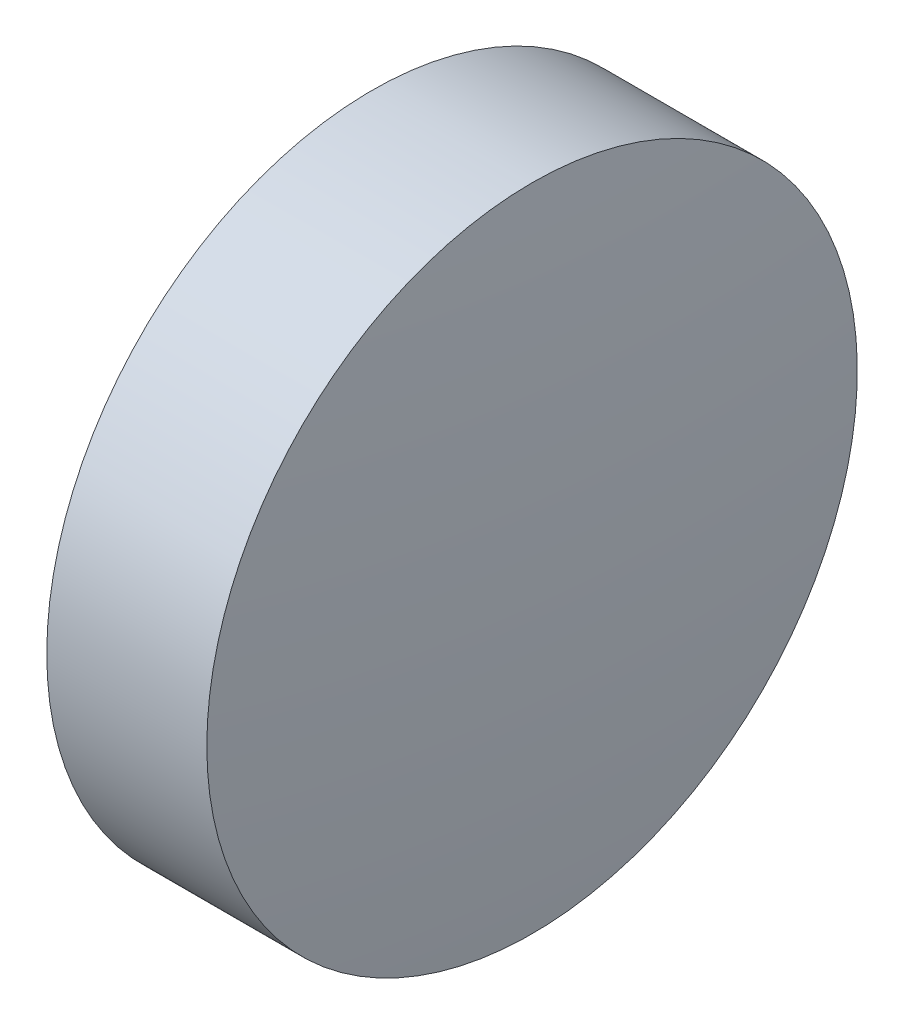
ISO-10303-21;
HEADER;
FILE_DESCRIPTION(('STEP AP214'),'2;1');
FILE_NAME('part.step','',(''),(''),'','','');
FILE_SCHEMA(('AUTOMOTIVE_DESIGN { 1 0 10303 214 1 1 1 1 }'));
ENDSEC;
DATA;
#1=APPLICATION_CONTEXT('core data for automotive mechanical design processes');
#2=APPLICATION_PROTOCOL_DEFINITION('international standard','automotive_design',2000,#1);
#3=PRODUCT_CONTEXT('',#1,'mechanical');
#4=PRODUCT('Part','Part','',(#3));
#5=PRODUCT_RELATED_PRODUCT_CATEGORY('part','',(#4));
#6=PRODUCT_DEFINITION_FORMATION('','',#4);
#7=PRODUCT_DEFINITION_CONTEXT('part definition',#1,'design');
#8=PRODUCT_DEFINITION('design','',#6,#7);
#9=PRODUCT_DEFINITION_SHAPE('','',#8);
#10=(LENGTH_UNIT() NAMED_UNIT(*) SI_UNIT(.MILLI.,.METRE.));
#11=(NAMED_UNIT(*) PLANE_ANGLE_UNIT() SI_UNIT($,.RADIAN.));
#12=(NAMED_UNIT(*) SI_UNIT($,.STERADIAN.) SOLID_ANGLE_UNIT());
#13=UNCERTAINTY_MEASURE_WITH_UNIT(LENGTH_MEASURE(1.E-05),#10,'distance_accuracy_value','');
#14=(GEOMETRIC_REPRESENTATION_CONTEXT(3) GLOBAL_UNCERTAINTY_ASSIGNED_CONTEXT((#13)) GLOBAL_UNIT_ASSIGNED_CONTEXT((#10,
#11,#12)) REPRESENTATION_CONTEXT('',''));
#15=CARTESIAN_POINT('',(0.,0.,0.));
#16=DIRECTION('',(0.,0.,1.));
#17=DIRECTION('',(1.,0.,0.));
#18=AXIS2_PLACEMENT_3D('',#15,#16,#17);
#19=CARTESIAN_POINT('',(1085.31152667328,408.864306221785,0.));
#20=DIRECTION('',(-1.,0.,0.));
#21=DIRECTION('',(0.,1.,0.));
#22=AXIS2_PLACEMENT_3D('',#19,#20,#21);
#23=SPHERICAL_SURFACE('',#22,33.1499999999998);
#24=CARTESIAN_POINT('',(1118.31152667328,408.864306221786,0.));
#25=DIRECTION('',(-1.,0.,0.));
#26=DIRECTION('',(0.,0.,1.));
#27=AXIS2_PLACEMENT_3D('',#24,#25,#26);
#28=CIRCLE('',#27,3.14999999999999);
#29=CARTESIAN_POINT('',(1118.31152667328,408.864306221786,3.14999999999999));
#30=VERTEX_POINT('',#29);
#31=EDGE_CURVE('E10',#30,#30,#28,.T.);
#32=ORIENTED_EDGE('',*,*,#31,.F.);
#33=EDGE_LOOP('',(#32));
#34=FACE_BOUND('',#33,.T.);
#35=ADVANCED_FACE('F35',(#34),#23,.T.);
#36=CARTESIAN_POINT('',(1116.27186868969,408.864306221786,0.));
#37=DIRECTION('',(-1.,0.,0.));
#38=DIRECTION('',(0.,0.,1.));
#39=AXIS2_PLACEMENT_3D('',#36,#37,#38);
#40=CYLINDRICAL_SURFACE('',#39,3.14999999999999);
#41=CARTESIAN_POINT('',(1116.76152667328,408.864306221786,0.));
#42=DIRECTION('',(-1.,0.,0.));
#43=DIRECTION('',(0.,0.,1.));
#44=AXIS2_PLACEMENT_3D('',#41,#42,#43);
#45=CIRCLE('',#44,3.14999999999999);
#46=CARTESIAN_POINT('',(1116.76152667328,408.864306221786,3.14999999999999));
#47=VERTEX_POINT('',#46);
#48=EDGE_CURVE('E41',#47,#47,#45,.T.);
#49=ORIENTED_EDGE('',*,*,#48,.F.);
#50=EDGE_LOOP('',(#49));
#51=FACE_BOUND('',#50,.T.);
#52=ORIENTED_EDGE('',*,*,#31,.T.);
#53=EDGE_LOOP('',(#52));
#54=FACE_BOUND('',#53,.T.);
#55=ADVANCED_FACE('F49',(#51,#54),#40,.T.);
#56=CARTESIAN_POINT('',(1116.76152667328,408.864306221786,0.));
#57=DIRECTION('',(1.,0.,0.));
#58=DIRECTION('',(0.,0.,-1.));
#59=AXIS2_PLACEMENT_3D('',#56,#57,#58);
#60=PLANE('',#59);
#61=ORIENTED_EDGE('',*,*,#48,.T.);
#62=EDGE_LOOP('',(#61));
#63=FACE_BOUND('',#62,.T.);
#64=ADVANCED_FACE('F47',(#63),#60,.F.);
#65=CLOSED_SHELL('',(#35,#55,#64));
#66=MANIFOLD_SOLID_BREP('B2',#65);
#67=ADVANCED_BREP_SHAPE_REPRESENTATION('',(#18,#66),#14);
#68=SHAPE_DEFINITION_REPRESENTATION(#9,#67);
ENDSEC;
END-ISO-10303-21;
